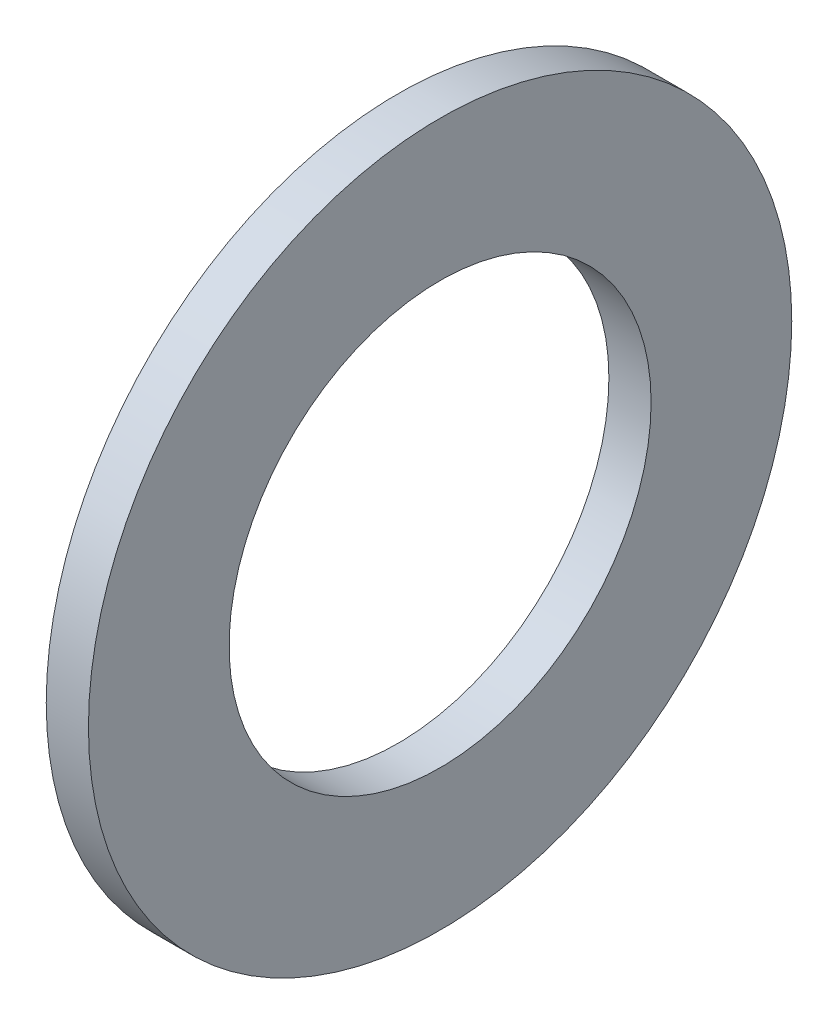
ISO-10303-21;
HEADER;
FILE_DESCRIPTION(('STEP AP214'),'2;1');
FILE_NAME('part.step','',(''),(''),'','','');
FILE_SCHEMA(('AUTOMOTIVE_DESIGN { 1 0 10303 214 1 1 1 1 }'));
ENDSEC;
DATA;
#1=APPLICATION_CONTEXT('core data for automotive mechanical design processes');
#2=APPLICATION_PROTOCOL_DEFINITION('international standard','automotive_design',2000,#1);
#3=PRODUCT_CONTEXT('',#1,'mechanical');
#4=PRODUCT('Part','Part','',(#3));
#5=PRODUCT_RELATED_PRODUCT_CATEGORY('part','',(#4));
#6=PRODUCT_DEFINITION_FORMATION('','',#4);
#7=PRODUCT_DEFINITION_CONTEXT('part definition',#1,'design');
#8=PRODUCT_DEFINITION('design','',#6,#7);
#9=PRODUCT_DEFINITION_SHAPE('','',#8);
#10=(LENGTH_UNIT() NAMED_UNIT(*) SI_UNIT(.MILLI.,.METRE.));
#11=(NAMED_UNIT(*) PLANE_ANGLE_UNIT() SI_UNIT($,.RADIAN.));
#12=(NAMED_UNIT(*) SI_UNIT($,.STERADIAN.) SOLID_ANGLE_UNIT());
#13=UNCERTAINTY_MEASURE_WITH_UNIT(LENGTH_MEASURE(1.E-05),#10,'distance_accuracy_value','');
#14=(GEOMETRIC_REPRESENTATION_CONTEXT(3) GLOBAL_UNCERTAINTY_ASSIGNED_CONTEXT((#13)) GLOBAL_UNIT_ASSIGNED_CONTEXT((#10,
#11,#12)) REPRESENTATION_CONTEXT('',''));
#15=CARTESIAN_POINT('',(0.,0.,0.));
#16=DIRECTION('',(0.,0.,1.));
#17=DIRECTION('',(1.,0.,0.));
#18=AXIS2_PLACEMENT_3D('',#15,#16,#17);
#19=CARTESIAN_POINT('',(0.762,0.,0.));
#20=DIRECTION('',(1.,0.,0.));
#21=DIRECTION('',(0.,0.,-1.));
#22=AXIS2_PLACEMENT_3D('',#19,#20,#21);
#23=PLANE('',#22);
#24=CARTESIAN_POINT('',(0.762,0.,0.));
#25=DIRECTION('',(1.,0.,0.));
#26=DIRECTION('',(0.,0.,-1.));
#27=AXIS2_PLACEMENT_3D('',#24,#25,#26);
#28=CIRCLE('',#27,6.35);
#29=CARTESIAN_POINT('',(0.762,0.,-6.35));
#30=VERTEX_POINT('',#29);
#31=EDGE_CURVE('E10',#30,#30,#28,.T.);
#32=ORIENTED_EDGE('',*,*,#31,.T.);
#33=EDGE_LOOP('',(#32));
#34=FACE_BOUND('',#33,.T.);
#35=CARTESIAN_POINT('',(0.762,0.,0.));
#36=DIRECTION('',(1.,0.,0.));
#37=DIRECTION('',(0.,0.,-1.));
#38=AXIS2_PLACEMENT_3D('',#35,#36,#37);
#39=CIRCLE('',#38,3.81);
#40=CARTESIAN_POINT('',(0.762,0.,-3.81));
#41=VERTEX_POINT('',#40);
#42=EDGE_CURVE('E50',#41,#41,#39,.T.);
#43=ORIENTED_EDGE('',*,*,#42,.F.);
#44=EDGE_LOOP('',(#43));
#45=FACE_BOUND('',#44,.T.);
#46=ADVANCED_FACE('F37',(#34,#45),#23,.T.);
#47=CARTESIAN_POINT('',(0.,0.,0.));
#48=DIRECTION('',(1.,0.,0.));
#49=DIRECTION('',(0.,0.,-1.));
#50=AXIS2_PLACEMENT_3D('',#47,#48,#49);
#51=PLANE('',#50);
#52=CARTESIAN_POINT('',(0.,0.,0.));
#53=DIRECTION('',(1.,0.,0.));
#54=DIRECTION('',(0.,0.,-1.));
#55=AXIS2_PLACEMENT_3D('',#52,#53,#54);
#56=CIRCLE('',#55,6.35);
#57=CARTESIAN_POINT('',(0.,0.,-6.35));
#58=VERTEX_POINT('',#57);
#59=EDGE_CURVE('E41',#58,#58,#56,.T.);
#60=ORIENTED_EDGE('',*,*,#59,.F.);
#61=EDGE_LOOP('',(#60));
#62=FACE_BOUND('',#61,.T.);
#63=CARTESIAN_POINT('',(0.,0.,0.));
#64=DIRECTION('',(1.,0.,0.));
#65=DIRECTION('',(0.,0.,-1.));
#66=AXIS2_PLACEMENT_3D('',#63,#64,#65);
#67=CIRCLE('',#66,3.81);
#68=CARTESIAN_POINT('',(0.,0.,-3.81));
#69=VERTEX_POINT('',#68);
#70=EDGE_CURVE('E52',#69,#69,#67,.T.);
#71=ORIENTED_EDGE('',*,*,#70,.T.);
#72=EDGE_LOOP('',(#71));
#73=FACE_BOUND('',#72,.T.);
#74=ADVANCED_FACE('F64',(#62,#73),#51,.F.);
#75=CARTESIAN_POINT('',(0.762,0.,0.));
#76=DIRECTION('',(-1.,0.,0.));
#77=DIRECTION('',(0.,0.,1.));
#78=AXIS2_PLACEMENT_3D('',#75,#76,#77);
#79=CYLINDRICAL_SURFACE('',#78,6.35);
#80=ORIENTED_EDGE('',*,*,#31,.F.);
#81=EDGE_LOOP('',(#80));
#82=FACE_BOUND('',#81,.T.);
#83=ORIENTED_EDGE('',*,*,#59,.T.);
#84=EDGE_LOOP('',(#83));
#85=FACE_BOUND('',#84,.T.);
#86=ADVANCED_FACE('F39',(#82,#85),#79,.T.);
#87=CARTESIAN_POINT('',(0.762,0.,0.));
#88=DIRECTION('',(-1.,0.,0.));
#89=DIRECTION('',(0.,0.,1.));
#90=AXIS2_PLACEMENT_3D('',#87,#88,#89);
#91=CYLINDRICAL_SURFACE('',#90,3.81);
#92=ORIENTED_EDGE('',*,*,#42,.T.);
#93=EDGE_LOOP('',(#92));
#94=FACE_BOUND('',#93,.T.);
#95=ORIENTED_EDGE('',*,*,#70,.F.);
#96=EDGE_LOOP('',(#95));
#97=FACE_BOUND('',#96,.T.);
#98=ADVANCED_FACE('F60',(#94,#97),#91,.F.);
#99=CLOSED_SHELL('',(#46,#74,#86,#98));
#100=MANIFOLD_SOLID_BREP('B2',#99);
#101=ADVANCED_BREP_SHAPE_REPRESENTATION('',(#18,#100),#14);
#102=SHAPE_DEFINITION_REPRESENTATION(#9,#101);
ENDSEC;
END-ISO-10303-21;
